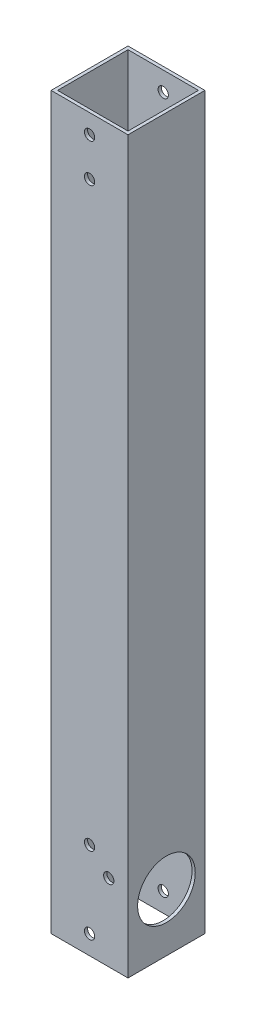
ISO-10303-21;
HEADER;
FILE_DESCRIPTION(('STEP AP214'),'2;1');
FILE_NAME('part.step','',(''),(''),'','','');
FILE_SCHEMA(('AUTOMOTIVE_DESIGN { 1 0 10303 214 1 1 1 1 }'));
ENDSEC;
DATA;
#1=APPLICATION_CONTEXT('core data for automotive mechanical design processes');
#2=APPLICATION_PROTOCOL_DEFINITION('international standard','automotive_design',2000,#1);
#3=PRODUCT_CONTEXT('',#1,'mechanical');
#4=PRODUCT('Part','Part','',(#3));
#5=PRODUCT_RELATED_PRODUCT_CATEGORY('part','',(#4));
#6=PRODUCT_DEFINITION_FORMATION('','',#4);
#7=PRODUCT_DEFINITION_CONTEXT('part definition',#1,'design');
#8=PRODUCT_DEFINITION('design','',#6,#7);
#9=PRODUCT_DEFINITION_SHAPE('','',#8);
#10=(LENGTH_UNIT() NAMED_UNIT(*) SI_UNIT(.MILLI.,.METRE.));
#11=(NAMED_UNIT(*) PLANE_ANGLE_UNIT() SI_UNIT($,.RADIAN.));
#12=(NAMED_UNIT(*) SI_UNIT($,.STERADIAN.) SOLID_ANGLE_UNIT());
#13=UNCERTAINTY_MEASURE_WITH_UNIT(LENGTH_MEASURE(1.E-05),#10,'distance_accuracy_value','');
#14=(GEOMETRIC_REPRESENTATION_CONTEXT(3) GLOBAL_UNCERTAINTY_ASSIGNED_CONTEXT((#13)) GLOBAL_UNIT_ASSIGNED_CONTEXT((#10,
#11,#12)) REPRESENTATION_CONTEXT('',''));
#15=CARTESIAN_POINT('',(0.,0.,0.));
#16=DIRECTION('',(0.,0.,1.));
#17=DIRECTION('',(1.,0.,0.));
#18=AXIS2_PLACEMENT_3D('',#15,#16,#17);
#19=CARTESIAN_POINT('',(-3.89865254481119,28.575,-19.05));
#20=DIRECTION('',(1.,0.,0.));
#21=DIRECTION('',(0.,0.,-1.));
#22=AXIS2_PLACEMENT_3D('',#19,#20,#21);
#23=CYLINDRICAL_SURFACE('',#22,14.2875);
#24=CARTESIAN_POINT('',(38.1,28.575,-19.05));
#25=DIRECTION('',(1.,0.,0.));
#26=DIRECTION('',(0.,0.,-1.));
#27=AXIS2_PLACEMENT_3D('',#24,#25,#26);
#28=CIRCLE('',#27,14.2875);
#29=CARTESIAN_POINT('',(38.1,28.575,-33.3375));
#30=VERTEX_POINT('',#29);
#31=EDGE_CURVE('E200',#30,#30,#28,.T.);
#32=ORIENTED_EDGE('',*,*,#31,.T.);
#33=EDGE_LOOP('',(#32));
#34=FACE_BOUND('',#33,.T.);
#35=CARTESIAN_POINT('',(36.5125,28.575,-19.05));
#36=DIRECTION('',(1.,0.,0.));
#37=DIRECTION('',(0.,0.,1.));
#38=AXIS2_PLACEMENT_3D('',#35,#36,#37);
#39=CIRCLE('',#38,14.2875);
#40=CARTESIAN_POINT('',(36.5125,28.575,-4.7625));
#41=VERTEX_POINT('',#40);
#42=EDGE_CURVE('E237',#41,#41,#39,.T.);
#43=ORIENTED_EDGE('',*,*,#42,.F.);
#44=EDGE_LOOP('',(#43));
#45=FACE_BOUND('',#44,.T.);
#46=ADVANCED_FACE('F51',(#34,#45),#23,.F.);
#47=CARTESIAN_POINT('',(19.05,9.525,-38.1));
#48=DIRECTION('',(0.,0.,1.));
#49=DIRECTION('',(1.,0.,0.));
#50=AXIS2_PLACEMENT_3D('',#47,#48,#49);
#51=CYLINDRICAL_SURFACE('',#50,2.5527);
#52=CARTESIAN_POINT('',(19.05,9.525,-1.5875));
#53=DIRECTION('',(0.,0.,-1.));
#54=DIRECTION('',(-1.,0.,0.));
#55=AXIS2_PLACEMENT_3D('',#52,#53,#54);
#56=CIRCLE('',#55,2.5527);
#57=CARTESIAN_POINT('',(16.4973,9.525,-1.5875));
#58=VERTEX_POINT('',#57);
#59=EDGE_CURVE('E225',#58,#58,#56,.T.);
#60=ORIENTED_EDGE('',*,*,#59,.T.);
#61=EDGE_LOOP('',(#60));
#62=FACE_BOUND('',#61,.T.);
#63=CARTESIAN_POINT('',(19.05,9.525,0.));
#64=DIRECTION('',(0.,0.,1.));
#65=DIRECTION('',(1.,0.,0.));
#66=AXIS2_PLACEMENT_3D('',#63,#64,#65);
#67=CIRCLE('',#66,2.5527);
#68=CARTESIAN_POINT('',(21.6027,9.525,0.));
#69=VERTEX_POINT('',#68);
#70=EDGE_CURVE('E324',#69,#69,#67,.T.);
#71=ORIENTED_EDGE('',*,*,#70,.T.);
#72=EDGE_LOOP('',(#71));
#73=FACE_BOUND('',#72,.T.);
#74=ADVANCED_FACE('F287',(#62,#73),#51,.F.);
#75=CARTESIAN_POINT('',(19.05,47.625,-38.1));
#76=DIRECTION('',(0.,0.,1.));
#77=DIRECTION('',(1.,0.,0.));
#78=AXIS2_PLACEMENT_3D('',#75,#76,#77);
#79=CYLINDRICAL_SURFACE('',#78,2.5527);
#80=CARTESIAN_POINT('',(19.05,47.625,-1.5875));
#81=DIRECTION('',(0.,0.,-1.));
#82=DIRECTION('',(-1.,0.,0.));
#83=AXIS2_PLACEMENT_3D('',#80,#81,#82);
#84=CIRCLE('',#83,2.5527);
#85=CARTESIAN_POINT('',(16.4973,47.625,-1.5875));
#86=VERTEX_POINT('',#85);
#87=EDGE_CURVE('E228',#86,#86,#84,.T.);
#88=ORIENTED_EDGE('',*,*,#87,.T.);
#89=EDGE_LOOP('',(#88));
#90=FACE_BOUND('',#89,.T.);
#91=CARTESIAN_POINT('',(19.05,47.625,0.));
#92=DIRECTION('',(0.,0.,1.));
#93=DIRECTION('',(1.,0.,0.));
#94=AXIS2_PLACEMENT_3D('',#91,#92,#93);
#95=CIRCLE('',#94,2.5527);
#96=CARTESIAN_POINT('',(21.6027,47.625,0.));
#97=VERTEX_POINT('',#96);
#98=EDGE_CURVE('E211',#97,#97,#95,.T.);
#99=ORIENTED_EDGE('',*,*,#98,.T.);
#100=EDGE_LOOP('',(#99));
#101=FACE_BOUND('',#100,.T.);
#102=ADVANCED_FACE('F293',(#90,#101),#79,.F.);
#103=CARTESIAN_POINT('',(28.575,38.1,-38.1));
#104=DIRECTION('',(0.,0.,1.));
#105=DIRECTION('',(1.,0.,0.));
#106=AXIS2_PLACEMENT_3D('',#103,#104,#105);
#107=CYLINDRICAL_SURFACE('',#106,2.5527);
#108=CARTESIAN_POINT('',(28.575,38.1,-1.5875));
#109=DIRECTION('',(0.,0.,-1.));
#110=DIRECTION('',(-1.,0.,0.));
#111=AXIS2_PLACEMENT_3D('',#108,#109,#110);
#112=CIRCLE('',#111,2.5527);
#113=CARTESIAN_POINT('',(26.0223,38.1,-1.5875));
#114=VERTEX_POINT('',#113);
#115=EDGE_CURVE('E231',#114,#114,#112,.T.);
#116=ORIENTED_EDGE('',*,*,#115,.T.);
#117=EDGE_LOOP('',(#116));
#118=FACE_BOUND('',#117,.T.);
#119=CARTESIAN_POINT('',(28.575,38.1,0.));
#120=DIRECTION('',(0.,0.,1.));
#121=DIRECTION('',(1.,0.,0.));
#122=AXIS2_PLACEMENT_3D('',#119,#120,#121);
#123=CIRCLE('',#122,2.5527);
#124=CARTESIAN_POINT('',(31.1277,38.1,0.));
#125=VERTEX_POINT('',#124);
#126=EDGE_CURVE('E201',#125,#125,#123,.T.);
#127=ORIENTED_EDGE('',*,*,#126,.T.);
#128=EDGE_LOOP('',(#127));
#129=FACE_BOUND('',#128,.T.);
#130=ADVANCED_FACE('F265',(#118,#129),#107,.F.);
#131=CARTESIAN_POINT('',(19.05,9.525,-38.1));
#132=DIRECTION('',(0.,0.,1.));
#133=DIRECTION('',(1.,0.,0.));
#134=AXIS2_PLACEMENT_3D('',#131,#132,#133);
#135=CYLINDRICAL_SURFACE('',#134,2.5527);
#136=CARTESIAN_POINT('',(19.05,9.525,-36.5125));
#137=DIRECTION('',(0.,0.,1.));
#138=DIRECTION('',(1.,0.,0.));
#139=AXIS2_PLACEMENT_3D('',#136,#137,#138);
#140=CIRCLE('',#139,2.5527);
#141=CARTESIAN_POINT('',(21.6027,9.525,-36.5125));
#142=VERTEX_POINT('',#141);
#143=EDGE_CURVE('E238',#142,#142,#140,.T.);
#144=ORIENTED_EDGE('',*,*,#143,.T.);
#145=EDGE_LOOP('',(#144));
#146=FACE_BOUND('',#145,.T.);
#147=CARTESIAN_POINT('',(19.05,9.525,-38.1));
#148=DIRECTION('',(0.,0.,1.));
#149=DIRECTION('',(1.,0.,0.));
#150=AXIS2_PLACEMENT_3D('',#147,#148,#149);
#151=CIRCLE('',#150,2.5527);
#152=CARTESIAN_POINT('',(21.6027,9.525,-38.1));
#153=VERTEX_POINT('',#152);
#154=EDGE_CURVE('E208',#153,#153,#151,.T.);
#155=ORIENTED_EDGE('',*,*,#154,.F.);
#156=EDGE_LOOP('',(#155));
#157=FACE_BOUND('',#156,.T.);
#158=ADVANCED_FACE('F262',(#146,#157),#135,.F.);
#159=CARTESIAN_POINT('',(19.05,47.625,-38.1));
#160=DIRECTION('',(0.,0.,1.));
#161=DIRECTION('',(1.,0.,0.));
#162=AXIS2_PLACEMENT_3D('',#159,#160,#161);
#163=CYLINDRICAL_SURFACE('',#162,2.5527);
#164=CARTESIAN_POINT('',(19.05,47.625,-36.5125));
#165=DIRECTION('',(0.,0.,1.));
#166=DIRECTION('',(1.,0.,0.));
#167=AXIS2_PLACEMENT_3D('',#164,#165,#166);
#168=CIRCLE('',#167,2.5527);
#169=CARTESIAN_POINT('',(21.6027,47.625,-36.5125));
#170=VERTEX_POINT('',#169);
#171=EDGE_CURVE('E59',#170,#170,#168,.T.);
#172=ORIENTED_EDGE('',*,*,#171,.T.);
#173=EDGE_LOOP('',(#172));
#174=FACE_BOUND('',#173,.T.);
#175=CARTESIAN_POINT('',(19.05,47.625,-38.1));
#176=DIRECTION('',(0.,0.,1.));
#177=DIRECTION('',(1.,0.,0.));
#178=AXIS2_PLACEMENT_3D('',#175,#176,#177);
#179=CIRCLE('',#178,2.5527);
#180=CARTESIAN_POINT('',(21.6027,47.625,-38.1));
#181=VERTEX_POINT('',#180);
#182=EDGE_CURVE('E217',#181,#181,#179,.T.);
#183=ORIENTED_EDGE('',*,*,#182,.F.);
#184=EDGE_LOOP('',(#183));
#185=FACE_BOUND('',#184,.T.);
#186=ADVANCED_FACE('F250',(#174,#185),#163,.F.);
#187=CARTESIAN_POINT('',(28.575,38.1,-38.1));
#188=DIRECTION('',(0.,0.,1.));
#189=DIRECTION('',(1.,0.,0.));
#190=AXIS2_PLACEMENT_3D('',#187,#188,#189);
#191=CYLINDRICAL_SURFACE('',#190,2.5527);
#192=CARTESIAN_POINT('',(28.575,38.1,-36.5125));
#193=DIRECTION('',(0.,0.,1.));
#194=DIRECTION('',(1.,0.,0.));
#195=AXIS2_PLACEMENT_3D('',#192,#193,#194);
#196=CIRCLE('',#195,2.5527);
#197=CARTESIAN_POINT('',(31.1277,38.1,-36.5125));
#198=VERTEX_POINT('',#197);
#199=EDGE_CURVE('E11',#198,#198,#196,.T.);
#200=ORIENTED_EDGE('',*,*,#199,.T.);
#201=EDGE_LOOP('',(#200));
#202=FACE_BOUND('',#201,.T.);
#203=CARTESIAN_POINT('',(28.575,38.1,-38.1));
#204=DIRECTION('',(0.,0.,1.));
#205=DIRECTION('',(1.,0.,0.));
#206=AXIS2_PLACEMENT_3D('',#203,#204,#205);
#207=CIRCLE('',#206,2.5527);
#208=CARTESIAN_POINT('',(31.1277,38.1,-38.1));
#209=VERTEX_POINT('',#208);
#210=EDGE_CURVE('E218',#209,#209,#207,.T.);
#211=ORIENTED_EDGE('',*,*,#210,.F.);
#212=EDGE_LOOP('',(#211));
#213=FACE_BOUND('',#212,.T.);
#214=ADVANCED_FACE('F531',(#202,#213),#191,.F.);
#215=CARTESIAN_POINT('',(1.5875,762.,-1.5875));
#216=DIRECTION('',(1.,0.,0.));
#217=DIRECTION('',(0.,1.,0.));
#218=AXIS2_PLACEMENT_3D('',#215,#216,#217);
#219=PLANE('',#218);
#220=DIRECTION('',(0.,0.,-1.));
#221=VECTOR('',#220,1.);
#222=CARTESIAN_POINT('',(1.5875,361.95,-1.5875));
#223=LINE('',#222,#221);
#224=CARTESIAN_POINT('',(1.5875,361.95,-1.5875));
#225=VERTEX_POINT('',#224);
#226=CARTESIAN_POINT('',(1.5875,361.95,-36.5125));
#227=VERTEX_POINT('',#226);
#228=EDGE_CURVE('E410',#225,#227,#223,.T.);
#229=ORIENTED_EDGE('',*,*,#228,.F.);
#230=DIRECTION('',(0.,-1.,0.));
#231=VECTOR('',#230,1.);
#232=CARTESIAN_POINT('',(1.5875,762.,-1.5875));
#233=LINE('',#232,#231);
#234=CARTESIAN_POINT('',(1.5875,0.,-1.5875));
#235=VERTEX_POINT('',#234);
#236=EDGE_CURVE('E221',#225,#235,#233,.T.);
#237=ORIENTED_EDGE('',*,*,#236,.T.);
#238=DIRECTION('',(0.,0.,1.));
#239=VECTOR('',#238,1.);
#240=CARTESIAN_POINT('',(1.5875,0.,-1.5875));
#241=LINE('',#240,#239);
#242=CARTESIAN_POINT('',(1.5875,0.,-36.5125));
#243=VERTEX_POINT('',#242);
#244=EDGE_CURVE('E378',#243,#235,#241,.T.);
#245=ORIENTED_EDGE('',*,*,#244,.F.);
#246=DIRECTION('',(0.,-1.,0.));
#247=VECTOR('',#246,1.);
#248=CARTESIAN_POINT('',(1.5875,762.,-36.5125));
#249=LINE('',#248,#247);
#250=EDGE_CURVE('E241',#227,#243,#249,.T.);
#251=ORIENTED_EDGE('',*,*,#250,.F.);
#252=EDGE_LOOP('',(#229,#237,#245,#251));
#253=FACE_BOUND('',#252,.T.);
#254=ADVANCED_FACE('F257',(#253),#219,.T.);
#255=CARTESIAN_POINT('',(1.5875,762.,-36.5125));
#256=DIRECTION('',(0.,0.,1.));
#257=DIRECTION('',(1.,0.,0.));
#258=AXIS2_PLACEMENT_3D('',#255,#256,#257);
#259=PLANE('',#258);
#260=CARTESIAN_POINT('',(19.05,352.425,-36.5125));
#261=DIRECTION('',(0.,0.,1.));
#262=DIRECTION('',(1.,0.,0.));
#263=AXIS2_PLACEMENT_3D('',#260,#261,#262);
#264=CIRCLE('',#263,2.55269999999997);
#265=CARTESIAN_POINT('',(21.6027,352.425,-36.5125));
#266=VERTEX_POINT('',#265);
#267=EDGE_CURVE('E706',#266,#266,#264,.F.);
#268=ORIENTED_EDGE('',*,*,#267,.T.);
#269=EDGE_LOOP('',(#268));
#270=FACE_BOUND('',#269,.T.);
#271=CARTESIAN_POINT('',(19.05,333.375,-36.5125));
#272=DIRECTION('',(0.,0.,1.));
#273=DIRECTION('',(1.,0.,0.));
#274=AXIS2_PLACEMENT_3D('',#271,#272,#273);
#275=CIRCLE('',#274,2.55269999999998);
#276=CARTESIAN_POINT('',(21.6027,333.375,-36.5125));
#277=VERTEX_POINT('',#276);
#278=EDGE_CURVE('E713',#277,#277,#275,.F.);
#279=ORIENTED_EDGE('',*,*,#278,.T.);
#280=EDGE_LOOP('',(#279));
#281=FACE_BOUND('',#280,.T.);
#282=DIRECTION('',(1.,0.,0.));
#283=VECTOR('',#282,1.);
#284=CARTESIAN_POINT('',(1.5875,361.95,-36.5125));
#285=LINE('',#284,#283);
#286=CARTESIAN_POINT('',(36.5125,361.95,-36.5125));
#287=VERTEX_POINT('',#286);
#288=EDGE_CURVE('E701',#227,#287,#285,.T.);
#289=ORIENTED_EDGE('',*,*,#288,.F.);
#290=ORIENTED_EDGE('',*,*,#250,.T.);
#291=DIRECTION('',(-1.,0.,0.));
#292=VECTOR('',#291,1.);
#293=CARTESIAN_POINT('',(1.5875,0.,-36.5125));
#294=LINE('',#293,#292);
#295=CARTESIAN_POINT('',(36.5125,0.,-36.5125));
#296=VERTEX_POINT('',#295);
#297=EDGE_CURVE('E354',#296,#243,#294,.T.);
#298=ORIENTED_EDGE('',*,*,#297,.F.);
#299=DIRECTION('',(0.,-1.,0.));
#300=VECTOR('',#299,1.);
#301=CARTESIAN_POINT('',(36.5125,762.,-36.5125));
#302=LINE('',#301,#300);
#303=EDGE_CURVE('E234',#287,#296,#302,.T.);
#304=ORIENTED_EDGE('',*,*,#303,.F.);
#305=EDGE_LOOP('',(#289,#290,#298,#304));
#306=FACE_BOUND('',#305,.T.);
#307=ORIENTED_EDGE('',*,*,#199,.F.);
#308=EDGE_LOOP('',(#307));
#309=FACE_BOUND('',#308,.T.);
#310=ORIENTED_EDGE('',*,*,#171,.F.);
#311=EDGE_LOOP('',(#310));
#312=FACE_BOUND('',#311,.T.);
#313=ORIENTED_EDGE('',*,*,#143,.F.);
#314=EDGE_LOOP('',(#313));
#315=FACE_BOUND('',#314,.T.);
#316=ADVANCED_FACE('F253',(#270,#281,#306,#309,#312,#315),#259,.T.);
#317=CARTESIAN_POINT('',(36.5125,762.,-1.5875));
#318=DIRECTION('',(-1.,0.,0.));
#319=DIRECTION('',(0.,0.,1.));
#320=AXIS2_PLACEMENT_3D('',#317,#318,#319);
#321=PLANE('',#320);
#322=DIRECTION('',(0.,0.,1.));
#323=VECTOR('',#322,1.);
#324=CARTESIAN_POINT('',(36.5125,361.95,-1.5875));
#325=LINE('',#324,#323);
#326=CARTESIAN_POINT('',(36.5125,361.95,-1.5875));
#327=VERTEX_POINT('',#326);
#328=EDGE_CURVE('E66',#287,#327,#325,.T.);
#329=ORIENTED_EDGE('',*,*,#328,.F.);
#330=ORIENTED_EDGE('',*,*,#303,.T.);
#331=DIRECTION('',(0.,0.,-1.));
#332=VECTOR('',#331,1.);
#333=CARTESIAN_POINT('',(36.5125,0.,-1.5875));
#334=LINE('',#333,#332);
#335=CARTESIAN_POINT('',(36.5125,0.,-1.5875));
#336=VERTEX_POINT('',#335);
#337=EDGE_CURVE('E359',#336,#296,#334,.T.);
#338=ORIENTED_EDGE('',*,*,#337,.F.);
#339=DIRECTION('',(0.,-1.,0.));
#340=VECTOR('',#339,1.);
#341=CARTESIAN_POINT('',(36.5125,762.,-1.5875));
#342=LINE('',#341,#340);
#343=EDGE_CURVE('E222',#327,#336,#342,.T.);
#344=ORIENTED_EDGE('',*,*,#343,.F.);
#345=EDGE_LOOP('',(#329,#330,#338,#344));
#346=FACE_BOUND('',#345,.T.);
#347=ORIENTED_EDGE('',*,*,#42,.T.);
#348=EDGE_LOOP('',(#347));
#349=FACE_BOUND('',#348,.T.);
#350=ADVANCED_FACE('F256',(#346,#349),#321,.T.);
#351=CARTESIAN_POINT('',(1.5875,762.,-1.5875));
#352=DIRECTION('',(0.,0.,-1.));
#353=DIRECTION('',(0.,-1.,0.));
#354=AXIS2_PLACEMENT_3D('',#351,#352,#353);
#355=PLANE('',#354);
#356=CARTESIAN_POINT('',(19.05,352.425,-1.5875));
#357=DIRECTION('',(0.,0.,-1.));
#358=DIRECTION('',(-1.,0.,0.));
#359=AXIS2_PLACEMENT_3D('',#356,#357,#358);
#360=CIRCLE('',#359,2.55269999999997);
#361=CARTESIAN_POINT('',(16.4973,352.425,-1.5875));
#362=VERTEX_POINT('',#361);
#363=EDGE_CURVE('E710',#362,#362,#360,.F.);
#364=ORIENTED_EDGE('',*,*,#363,.T.);
#365=EDGE_LOOP('',(#364));
#366=FACE_BOUND('',#365,.T.);
#367=CARTESIAN_POINT('',(19.05,333.375,-1.5875));
#368=DIRECTION('',(0.,0.,-1.));
#369=DIRECTION('',(-1.,0.,0.));
#370=AXIS2_PLACEMENT_3D('',#367,#368,#369);
#371=CIRCLE('',#370,2.55269999999998);
#372=CARTESIAN_POINT('',(16.4973,333.375,-1.5875));
#373=VERTEX_POINT('',#372);
#374=EDGE_CURVE('E716',#373,#373,#371,.F.);
#375=ORIENTED_EDGE('',*,*,#374,.T.);
#376=EDGE_LOOP('',(#375));
#377=FACE_BOUND('',#376,.T.);
#378=DIRECTION('',(-1.,0.,0.));
#379=VECTOR('',#378,1.);
#380=CARTESIAN_POINT('',(1.5875,361.95,-1.5875));
#381=LINE('',#380,#379);
#382=EDGE_CURVE('E184',#327,#225,#381,.T.);
#383=ORIENTED_EDGE('',*,*,#382,.F.);
#384=ORIENTED_EDGE('',*,*,#343,.T.);
#385=DIRECTION('',(1.,0.,0.));
#386=VECTOR('',#385,1.);
#387=CARTESIAN_POINT('',(1.5875,0.,-1.5875));
#388=LINE('',#387,#386);
#389=EDGE_CURVE('E369',#235,#336,#388,.T.);
#390=ORIENTED_EDGE('',*,*,#389,.F.);
#391=ORIENTED_EDGE('',*,*,#236,.F.);
#392=EDGE_LOOP('',(#383,#384,#390,#391));
#393=FACE_BOUND('',#392,.T.);
#394=ORIENTED_EDGE('',*,*,#115,.F.);
#395=EDGE_LOOP('',(#394));
#396=FACE_BOUND('',#395,.T.);
#397=ORIENTED_EDGE('',*,*,#87,.F.);
#398=EDGE_LOOP('',(#397));
#399=FACE_BOUND('',#398,.T.);
#400=ORIENTED_EDGE('',*,*,#59,.F.);
#401=EDGE_LOOP('',(#400));
#402=FACE_BOUND('',#401,.T.);
#403=ADVANCED_FACE('F270',(#366,#377,#393,#396,#399,#402),#355,.T.);
#404=CARTESIAN_POINT('',(0.,762.,-38.1));
#405=DIRECTION('',(0.,0.,1.));
#406=DIRECTION('',(1.,0.,0.));
#407=AXIS2_PLACEMENT_3D('',#404,#405,#406);
#408=PLANE('',#407);
#409=CARTESIAN_POINT('',(19.05,352.425,-38.1));
#410=DIRECTION('',(0.,0.,-1.));
#411=DIRECTION('',(-1.,0.,0.));
#412=AXIS2_PLACEMENT_3D('',#409,#410,#411);
#413=CIRCLE('',#412,2.55269999999997);
#414=CARTESIAN_POINT('',(16.4973,352.425,-38.1));
#415=VERTEX_POINT('',#414);
#416=EDGE_CURVE('E719',#415,#415,#413,.T.);
#417=ORIENTED_EDGE('',*,*,#416,.F.);
#418=EDGE_LOOP('',(#417));
#419=FACE_BOUND('',#418,.T.);
#420=CARTESIAN_POINT('',(19.05,333.375,-38.1));
#421=DIRECTION('',(0.,0.,-1.));
#422=DIRECTION('',(-1.,0.,0.));
#423=AXIS2_PLACEMENT_3D('',#420,#421,#422);
#424=CIRCLE('',#423,2.55269999999998);
#425=CARTESIAN_POINT('',(16.4973,333.375,-38.1));
#426=VERTEX_POINT('',#425);
#427=EDGE_CURVE('E720',#426,#426,#424,.T.);
#428=ORIENTED_EDGE('',*,*,#427,.F.);
#429=EDGE_LOOP('',(#428));
#430=FACE_BOUND('',#429,.T.);
#431=ORIENTED_EDGE('',*,*,#210,.T.);
#432=EDGE_LOOP('',(#431));
#433=FACE_BOUND('',#432,.T.);
#434=ORIENTED_EDGE('',*,*,#182,.T.);
#435=EDGE_LOOP('',(#434));
#436=FACE_BOUND('',#435,.T.);
#437=ORIENTED_EDGE('',*,*,#154,.T.);
#438=EDGE_LOOP('',(#437));
#439=FACE_BOUND('',#438,.T.);
#440=DIRECTION('',(0.,-1.,0.));
#441=VECTOR('',#440,1.);
#442=CARTESIAN_POINT('',(0.,762.,-38.1));
#443=LINE('',#442,#441);
#444=CARTESIAN_POINT('',(0.,361.95,-38.1));
#445=VERTEX_POINT('',#444);
#446=CARTESIAN_POINT('',(0.,0.,-38.1));
#447=VERTEX_POINT('',#446);
#448=EDGE_CURVE('E193',#445,#447,#443,.T.);
#449=ORIENTED_EDGE('',*,*,#448,.F.);
#450=DIRECTION('',(1.,0.,0.));
#451=VECTOR('',#450,1.);
#452=CARTESIAN_POINT('',(0.,361.95,-38.1));
#453=LINE('',#452,#451);
#454=CARTESIAN_POINT('',(38.1,361.95,-38.1));
#455=VERTEX_POINT('',#454);
#456=EDGE_CURVE('E74',#445,#455,#453,.T.);
#457=ORIENTED_EDGE('',*,*,#456,.T.);
#458=DIRECTION('',(0.,-1.,0.));
#459=VECTOR('',#458,1.);
#460=CARTESIAN_POINT('',(38.1,762.,-38.1));
#461=LINE('',#460,#459);
#462=CARTESIAN_POINT('',(38.1,0.,-38.1));
#463=VERTEX_POINT('',#462);
#464=EDGE_CURVE('E191',#455,#463,#461,.T.);
#465=ORIENTED_EDGE('',*,*,#464,.T.);
#466=DIRECTION('',(-1.,0.,0.));
#467=VECTOR('',#466,1.);
#468=CARTESIAN_POINT('',(0.,0.,-38.1));
#469=LINE('',#468,#467);
#470=EDGE_CURVE('E397',#463,#447,#469,.T.);
#471=ORIENTED_EDGE('',*,*,#470,.T.);
#472=EDGE_LOOP('',(#449,#457,#465,#471));
#473=FACE_BOUND('',#472,.T.);
#474=ADVANCED_FACE('F189',(#419,#430,#433,#436,#439,#473),#408,.F.);
#475=CARTESIAN_POINT('',(38.1,762.,0.));
#476=DIRECTION('',(-1.,0.,0.));
#477=DIRECTION('',(0.,0.,1.));
#478=AXIS2_PLACEMENT_3D('',#475,#476,#477);
#479=PLANE('',#478);
#480=ORIENTED_EDGE('',*,*,#31,.F.);
#481=EDGE_LOOP('',(#480));
#482=FACE_BOUND('',#481,.T.);
#483=ORIENTED_EDGE('',*,*,#464,.F.);
#484=DIRECTION('',(0.,0.,1.));
#485=VECTOR('',#484,1.);
#486=CARTESIAN_POINT('',(38.1,361.95,-38.1));
#487=LINE('',#486,#485);
#488=CARTESIAN_POINT('',(38.1,361.95,0.));
#489=VERTEX_POINT('',#488);
#490=EDGE_CURVE('E177',#455,#489,#487,.T.);
#491=ORIENTED_EDGE('',*,*,#490,.T.);
#492=DIRECTION('',(0.,-1.,0.));
#493=VECTOR('',#492,1.);
#494=CARTESIAN_POINT('',(38.1,762.,0.));
#495=LINE('',#494,#493);
#496=CARTESIAN_POINT('',(38.1,0.,0.));
#497=VERTEX_POINT('',#496);
#498=EDGE_CURVE('E326',#489,#497,#495,.T.);
#499=ORIENTED_EDGE('',*,*,#498,.T.);
#500=DIRECTION('',(0.,0.,-1.));
#501=VECTOR('',#500,1.);
#502=CARTESIAN_POINT('',(38.1,0.,0.));
#503=LINE('',#502,#501);
#504=EDGE_CURVE('E197',#497,#463,#503,.T.);
#505=ORIENTED_EDGE('',*,*,#504,.T.);
#506=EDGE_LOOP('',(#483,#491,#499,#505));
#507=FACE_BOUND('',#506,.T.);
#508=ADVANCED_FACE('F195',(#482,#507),#479,.F.);
#509=CARTESIAN_POINT('',(0.,762.,0.));
#510=DIRECTION('',(0.,0.,-1.));
#511=DIRECTION('',(0.,-1.,0.));
#512=AXIS2_PLACEMENT_3D('',#509,#510,#511);
#513=PLANE('',#512);
#514=CARTESIAN_POINT('',(19.05,352.425,0.));
#515=DIRECTION('',(0.,0.,-1.));
#516=DIRECTION('',(-1.,0.,0.));
#517=AXIS2_PLACEMENT_3D('',#514,#515,#516);
#518=CIRCLE('',#517,2.55269999999997);
#519=CARTESIAN_POINT('',(16.4973,352.425,0.));
#520=VERTEX_POINT('',#519);
#521=EDGE_CURVE('E726',#520,#520,#518,.T.);
#522=ORIENTED_EDGE('',*,*,#521,.T.);
#523=EDGE_LOOP('',(#522));
#524=FACE_BOUND('',#523,.T.);
#525=CARTESIAN_POINT('',(19.05,333.375,0.));
#526=DIRECTION('',(0.,0.,-1.));
#527=DIRECTION('',(-1.,0.,0.));
#528=AXIS2_PLACEMENT_3D('',#525,#526,#527);
#529=CIRCLE('',#528,2.55269999999998);
#530=CARTESIAN_POINT('',(16.4973,333.375,0.));
#531=VERTEX_POINT('',#530);
#532=EDGE_CURVE('E723',#531,#531,#529,.T.);
#533=ORIENTED_EDGE('',*,*,#532,.T.);
#534=EDGE_LOOP('',(#533));
#535=FACE_BOUND('',#534,.T.);
#536=ORIENTED_EDGE('',*,*,#126,.F.);
#537=EDGE_LOOP('',(#536));
#538=FACE_BOUND('',#537,.T.);
#539=ORIENTED_EDGE('',*,*,#98,.F.);
#540=EDGE_LOOP('',(#539));
#541=FACE_BOUND('',#540,.T.);
#542=ORIENTED_EDGE('',*,*,#70,.F.);
#543=EDGE_LOOP('',(#542));
#544=FACE_BOUND('',#543,.T.);
#545=ORIENTED_EDGE('',*,*,#498,.F.);
#546=DIRECTION('',(1.,0.,0.));
#547=VECTOR('',#546,1.);
#548=CARTESIAN_POINT('',(0.,361.95,0.));
#549=LINE('',#548,#547);
#550=CARTESIAN_POINT('',(0.,361.95,0.));
#551=VERTEX_POINT('',#550);
#552=EDGE_CURVE('E180',#551,#489,#549,.T.);
#553=ORIENTED_EDGE('',*,*,#552,.F.);
#554=DIRECTION('',(0.,-1.,0.));
#555=VECTOR('',#554,1.);
#556=CARTESIAN_POINT('',(0.,762.,0.));
#557=LINE('',#556,#555);
#558=CARTESIAN_POINT('',(0.,0.,0.));
#559=VERTEX_POINT('',#558);
#560=EDGE_CURVE('E336',#551,#559,#557,.T.);
#561=ORIENTED_EDGE('',*,*,#560,.T.);
#562=DIRECTION('',(1.,0.,0.));
#563=VECTOR('',#562,1.);
#564=CARTESIAN_POINT('',(0.,0.,0.));
#565=LINE('',#564,#563);
#566=EDGE_CURVE('E329',#559,#497,#565,.T.);
#567=ORIENTED_EDGE('',*,*,#566,.T.);
#568=EDGE_LOOP('',(#545,#553,#561,#567));
#569=FACE_BOUND('',#568,.T.);
#570=ADVANCED_FACE('F278',(#524,#535,#538,#541,#544,#569),#513,.F.);
#571=CARTESIAN_POINT('',(0.,762.,0.));
#572=DIRECTION('',(1.,0.,0.));
#573=DIRECTION('',(0.,1.,0.));
#574=AXIS2_PLACEMENT_3D('',#571,#572,#573);
#575=PLANE('',#574);
#576=ORIENTED_EDGE('',*,*,#560,.F.);
#577=DIRECTION('',(0.,0.,1.));
#578=VECTOR('',#577,1.);
#579=CARTESIAN_POINT('',(0.,361.95,-38.1));
#580=LINE('',#579,#578);
#581=EDGE_CURVE('E185',#445,#551,#580,.T.);
#582=ORIENTED_EDGE('',*,*,#581,.F.);
#583=ORIENTED_EDGE('',*,*,#448,.T.);
#584=DIRECTION('',(0.,0.,1.));
#585=VECTOR('',#584,1.);
#586=CARTESIAN_POINT('',(0.,0.,0.));
#587=LINE('',#586,#585);
#588=EDGE_CURVE('E403',#447,#559,#587,.T.);
#589=ORIENTED_EDGE('',*,*,#588,.T.);
#590=EDGE_LOOP('',(#576,#582,#583,#589));
#591=FACE_BOUND('',#590,.T.);
#592=ADVANCED_FACE('F317',(#591),#575,.F.);
#593=CARTESIAN_POINT('',(0.,0.,0.));
#594=DIRECTION('',(0.,-1.,0.));
#595=DIRECTION('',(0.,0.,-1.));
#596=AXIS2_PLACEMENT_3D('',#593,#594,#595);
#597=PLANE('',#596);
#598=ORIENTED_EDGE('',*,*,#244,.T.);
#599=ORIENTED_EDGE('',*,*,#389,.T.);
#600=ORIENTED_EDGE('',*,*,#337,.T.);
#601=ORIENTED_EDGE('',*,*,#297,.T.);
#602=EDGE_LOOP('',(#598,#599,#600,#601));
#603=FACE_BOUND('',#602,.T.);
#604=ORIENTED_EDGE('',*,*,#588,.F.);
#605=ORIENTED_EDGE('',*,*,#470,.F.);
#606=ORIENTED_EDGE('',*,*,#504,.F.);
#607=ORIENTED_EDGE('',*,*,#566,.F.);
#608=EDGE_LOOP('',(#604,#605,#606,#607));
#609=FACE_BOUND('',#608,.T.);
#610=ADVANCED_FACE('F604',(#603,#609),#597,.T.);
#611=CARTESIAN_POINT('',(0.,361.95,-38.1));
#612=DIRECTION('',(0.,-1.,0.));
#613=DIRECTION('',(0.,0.,-1.));
#614=AXIS2_PLACEMENT_3D('',#611,#612,#613);
#615=PLANE('',#614);
#616=ORIENTED_EDGE('',*,*,#228,.T.);
#617=ORIENTED_EDGE('',*,*,#288,.T.);
#618=ORIENTED_EDGE('',*,*,#328,.T.);
#619=ORIENTED_EDGE('',*,*,#382,.T.);
#620=EDGE_LOOP('',(#616,#617,#618,#619));
#621=FACE_BOUND('',#620,.T.);
#622=ORIENTED_EDGE('',*,*,#552,.T.);
#623=ORIENTED_EDGE('',*,*,#490,.F.);
#624=ORIENTED_EDGE('',*,*,#456,.F.);
#625=ORIENTED_EDGE('',*,*,#581,.T.);
#626=EDGE_LOOP('',(#622,#623,#624,#625));
#627=FACE_BOUND('',#626,.T.);
#628=ADVANCED_FACE('F178',(#621,#627),#615,.F.);
#629=CARTESIAN_POINT('',(19.05,333.375,-38.1));
#630=DIRECTION('',(0.,0.,1.));
#631=DIRECTION('',(1.,0.,0.));
#632=AXIS2_PLACEMENT_3D('',#629,#630,#631);
#633=CYLINDRICAL_SURFACE('',#632,2.55269999999998);
#634=ORIENTED_EDGE('',*,*,#374,.F.);
#635=EDGE_LOOP('',(#634));
#636=FACE_BOUND('',#635,.T.);
#637=ORIENTED_EDGE('',*,*,#532,.F.);
#638=EDGE_LOOP('',(#637));
#639=FACE_BOUND('',#638,.T.);
#640=ADVANCED_FACE('F742',(#636,#639),#633,.F.);
#641=CARTESIAN_POINT('',(19.05,352.425,-38.1));
#642=DIRECTION('',(0.,0.,1.));
#643=DIRECTION('',(1.,0.,0.));
#644=AXIS2_PLACEMENT_3D('',#641,#642,#643);
#645=CYLINDRICAL_SURFACE('',#644,2.55269999999997);
#646=ORIENTED_EDGE('',*,*,#363,.F.);
#647=EDGE_LOOP('',(#646));
#648=FACE_BOUND('',#647,.T.);
#649=ORIENTED_EDGE('',*,*,#521,.F.);
#650=EDGE_LOOP('',(#649));
#651=FACE_BOUND('',#650,.T.);
#652=ADVANCED_FACE('F736',(#648,#651),#645,.F.);
#653=ORIENTED_EDGE('',*,*,#278,.F.);
#654=EDGE_LOOP('',(#653));
#655=FACE_BOUND('',#654,.T.);
#656=ORIENTED_EDGE('',*,*,#427,.T.);
#657=EDGE_LOOP('',(#656));
#658=FACE_BOUND('',#657,.T.);
#659=ADVANCED_FACE('F733',(#655,#658),#633,.F.);
#660=ORIENTED_EDGE('',*,*,#267,.F.);
#661=EDGE_LOOP('',(#660));
#662=FACE_BOUND('',#661,.T.);
#663=ORIENTED_EDGE('',*,*,#416,.T.);
#664=EDGE_LOOP('',(#663));
#665=FACE_BOUND('',#664,.T.);
#666=ADVANCED_FACE('F731',(#662,#665),#645,.F.);
#667=CLOSED_SHELL('',(#46,#74,#102,#130,#158,#186,#214,#254,#316,#350,#403,#474,#508,#570,#592,
#610,#628,#640,#652,#659,#666));
#668=MANIFOLD_SOLID_BREP('B2',#667);
#669=ADVANCED_BREP_SHAPE_REPRESENTATION('',(#18,#668),#14);
#670=SHAPE_DEFINITION_REPRESENTATION(#9,#669);
ENDSEC;
END-ISO-10303-21;
